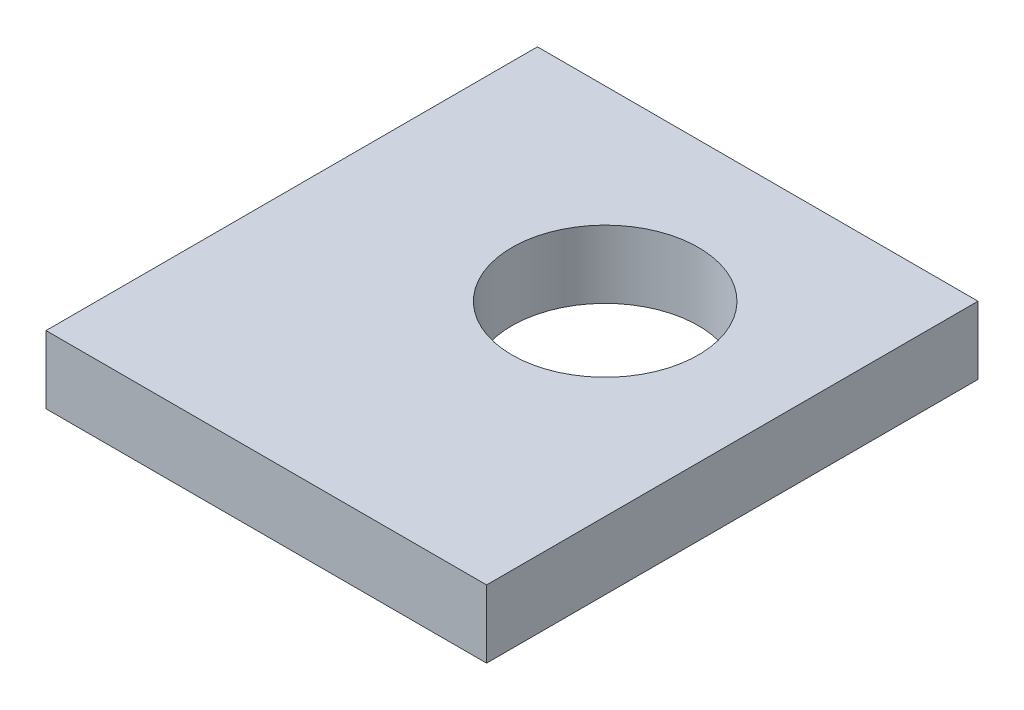
ISO-10303-21;
HEADER;
FILE_DESCRIPTION(('STEP AP214'),'2;1');
FILE_NAME('part.step','',(''),(''),'','','');
FILE_SCHEMA(('AUTOMOTIVE_DESIGN { 1 0 10303 214 1 1 1 1 }'));
ENDSEC;
DATA;
#1=APPLICATION_CONTEXT('core data for automotive mechanical design processes');
#2=APPLICATION_PROTOCOL_DEFINITION('international standard','automotive_design',2000,#1);
#3=PRODUCT_CONTEXT('',#1,'mechanical');
#4=PRODUCT('Part','Part','',(#3));
#5=PRODUCT_RELATED_PRODUCT_CATEGORY('part','',(#4));
#6=PRODUCT_DEFINITION_FORMATION('','',#4);
#7=PRODUCT_DEFINITION_CONTEXT('part definition',#1,'design');
#8=PRODUCT_DEFINITION('design','',#6,#7);
#9=PRODUCT_DEFINITION_SHAPE('','',#8);
#10=(LENGTH_UNIT() NAMED_UNIT(*) SI_UNIT(.MILLI.,.METRE.));
#11=(NAMED_UNIT(*) PLANE_ANGLE_UNIT() SI_UNIT($,.RADIAN.));
#12=(NAMED_UNIT(*) SI_UNIT($,.STERADIAN.) SOLID_ANGLE_UNIT());
#13=UNCERTAINTY_MEASURE_WITH_UNIT(LENGTH_MEASURE(1.E-05),#10,'distance_accuracy_value','');
#14=(GEOMETRIC_REPRESENTATION_CONTEXT(3) GLOBAL_UNCERTAINTY_ASSIGNED_CONTEXT((#13)) GLOBAL_UNIT_ASSIGNED_CONTEXT((#10,
#11,#12)) REPRESENTATION_CONTEXT('',''));
#15=CARTESIAN_POINT('',(0.,0.,0.));
#16=DIRECTION('',(0.,0.,1.));
#17=DIRECTION('',(1.,0.,0.));
#18=AXIS2_PLACEMENT_3D('',#15,#16,#17);
#19=CARTESIAN_POINT('',(0.,4.,0.));
#20=DIRECTION('',(0.,-1.,0.));
#21=DIRECTION('',(0.,0.,-1.));
#22=AXIS2_PLACEMENT_3D('',#19,#20,#21);
#23=PLANE('',#22);
#24=DIRECTION('',(0.,0.,1.));
#25=VECTOR('',#24,1.);
#26=CARTESIAN_POINT('',(0.,4.,0.));
#27=LINE('',#26,#25);
#28=CARTESIAN_POINT('',(0.,4.,-29.));
#29=VERTEX_POINT('',#28);
#30=CARTESIAN_POINT('',(0.,4.,0.));
#31=VERTEX_POINT('',#30);
#32=EDGE_CURVE('E86',#29,#31,#27,.T.);
#33=ORIENTED_EDGE('',*,*,#32,.T.);
#34=DIRECTION('',(1.,0.,0.));
#35=VECTOR('',#34,1.);
#36=CARTESIAN_POINT('',(0.,4.,0.));
#37=LINE('',#36,#35);
#38=CARTESIAN_POINT('',(26.,4.,0.));
#39=VERTEX_POINT('',#38);
#40=EDGE_CURVE('E81',#31,#39,#37,.T.);
#41=ORIENTED_EDGE('',*,*,#40,.T.);
#42=DIRECTION('',(0.,0.,-1.));
#43=VECTOR('',#42,1.);
#44=CARTESIAN_POINT('',(26.,4.,0.));
#45=LINE('',#44,#43);
#46=CARTESIAN_POINT('',(26.,4.,-29.));
#47=VERTEX_POINT('',#46);
#48=EDGE_CURVE('E84',#39,#47,#45,.T.);
#49=ORIENTED_EDGE('',*,*,#48,.T.);
#50=DIRECTION('',(-1.,0.,0.));
#51=VECTOR('',#50,1.);
#52=CARTESIAN_POINT('',(0.,4.,-29.));
#53=LINE('',#52,#51);
#54=EDGE_CURVE('E51',#47,#29,#53,.T.);
#55=ORIENTED_EDGE('',*,*,#54,.T.);
#56=EDGE_LOOP('',(#33,#41,#49,#55));
#57=FACE_BOUND('',#56,.T.);
#58=CARTESIAN_POINT('',(15.,4.,-18.));
#59=DIRECTION('',(0.,1.,0.));
#60=DIRECTION('',(0.,0.,1.));
#61=AXIS2_PLACEMENT_3D('',#58,#59,#60);
#62=CIRCLE('',#61,5.5);
#63=CARTESIAN_POINT('',(15.,4.,-12.5));
#64=VERTEX_POINT('',#63);
#65=EDGE_CURVE('E101',#64,#64,#62,.T.);
#66=ORIENTED_EDGE('',*,*,#65,.F.);
#67=EDGE_LOOP('',(#66));
#68=FACE_BOUND('',#67,.T.);
#69=ADVANCED_FACE('F34',(#57,#68),#23,.F.);
#70=CARTESIAN_POINT('',(0.,0.,0.));
#71=DIRECTION('',(0.,-1.,0.));
#72=DIRECTION('',(0.,0.,-1.));
#73=AXIS2_PLACEMENT_3D('',#70,#71,#72);
#74=PLANE('',#73);
#75=DIRECTION('',(0.,0.,1.));
#76=VECTOR('',#75,1.);
#77=CARTESIAN_POINT('',(0.,0.,0.));
#78=LINE('',#77,#76);
#79=CARTESIAN_POINT('',(0.,0.,-29.));
#80=VERTEX_POINT('',#79);
#81=CARTESIAN_POINT('',(0.,0.,0.));
#82=VERTEX_POINT('',#81);
#83=EDGE_CURVE('E98',#80,#82,#78,.T.);
#84=ORIENTED_EDGE('',*,*,#83,.F.);
#85=DIRECTION('',(-1.,0.,0.));
#86=VECTOR('',#85,1.);
#87=CARTESIAN_POINT('',(0.,0.,-29.));
#88=LINE('',#87,#86);
#89=CARTESIAN_POINT('',(26.,0.,-29.));
#90=VERTEX_POINT('',#89);
#91=EDGE_CURVE('E74',#90,#80,#88,.T.);
#92=ORIENTED_EDGE('',*,*,#91,.F.);
#93=DIRECTION('',(0.,0.,-1.));
#94=VECTOR('',#93,1.);
#95=CARTESIAN_POINT('',(26.,0.,0.));
#96=LINE('',#95,#94);
#97=CARTESIAN_POINT('',(26.,0.,0.));
#98=VERTEX_POINT('',#97);
#99=EDGE_CURVE('E68',#98,#90,#96,.T.);
#100=ORIENTED_EDGE('',*,*,#99,.F.);
#101=DIRECTION('',(1.,0.,0.));
#102=VECTOR('',#101,1.);
#103=CARTESIAN_POINT('',(0.,0.,0.));
#104=LINE('',#103,#102);
#105=EDGE_CURVE('E90',#82,#98,#104,.T.);
#106=ORIENTED_EDGE('',*,*,#105,.F.);
#107=EDGE_LOOP('',(#84,#92,#100,#106));
#108=FACE_BOUND('',#107,.T.);
#109=CARTESIAN_POINT('',(15.,0.,-18.));
#110=DIRECTION('',(0.,1.,0.));
#111=DIRECTION('',(0.,0.,1.));
#112=AXIS2_PLACEMENT_3D('',#109,#110,#111);
#113=CIRCLE('',#112,5.5);
#114=CARTESIAN_POINT('',(15.,0.,-12.5));
#115=VERTEX_POINT('',#114);
#116=EDGE_CURVE('E113',#115,#115,#113,.T.);
#117=ORIENTED_EDGE('',*,*,#116,.T.);
#118=EDGE_LOOP('',(#117));
#119=FACE_BOUND('',#118,.T.);
#120=ADVANCED_FACE('F109',(#108,#119),#74,.T.);
#121=CARTESIAN_POINT('',(0.,4.,0.));
#122=DIRECTION('',(1.,0.,0.));
#123=DIRECTION('',(0.,0.,-1.));
#124=AXIS2_PLACEMENT_3D('',#121,#122,#123);
#125=PLANE('',#124);
#126=ORIENTED_EDGE('',*,*,#83,.T.);
#127=DIRECTION('',(0.,-1.,0.));
#128=VECTOR('',#127,1.);
#129=CARTESIAN_POINT('',(0.,4.,0.));
#130=LINE('',#129,#128);
#131=EDGE_CURVE('E11',#31,#82,#130,.T.);
#132=ORIENTED_EDGE('',*,*,#131,.F.);
#133=ORIENTED_EDGE('',*,*,#32,.F.);
#134=DIRECTION('',(0.,-1.,0.));
#135=VECTOR('',#134,1.);
#136=CARTESIAN_POINT('',(0.,4.,-29.));
#137=LINE('',#136,#135);
#138=EDGE_CURVE('E94',#29,#80,#137,.T.);
#139=ORIENTED_EDGE('',*,*,#138,.T.);
#140=EDGE_LOOP('',(#126,#132,#133,#139));
#141=FACE_BOUND('',#140,.T.);
#142=ADVANCED_FACE('F36',(#141),#125,.F.);
#143=CARTESIAN_POINT('',(0.,4.,0.));
#144=DIRECTION('',(0.,0.,-1.));
#145=DIRECTION('',(-1.,0.,0.));
#146=AXIS2_PLACEMENT_3D('',#143,#144,#145);
#147=PLANE('',#146);
#148=ORIENTED_EDGE('',*,*,#105,.T.);
#149=DIRECTION('',(0.,-1.,0.));
#150=VECTOR('',#149,1.);
#151=CARTESIAN_POINT('',(26.,4.,0.));
#152=LINE('',#151,#150);
#153=EDGE_CURVE('E43',#39,#98,#152,.T.);
#154=ORIENTED_EDGE('',*,*,#153,.F.);
#155=ORIENTED_EDGE('',*,*,#40,.F.);
#156=ORIENTED_EDGE('',*,*,#131,.T.);
#157=EDGE_LOOP('',(#148,#154,#155,#156));
#158=FACE_BOUND('',#157,.T.);
#159=ADVANCED_FACE('F89',(#158),#147,.F.);
#160=CARTESIAN_POINT('',(26.,4.,0.));
#161=DIRECTION('',(-1.,0.,0.));
#162=DIRECTION('',(0.,0.,1.));
#163=AXIS2_PLACEMENT_3D('',#160,#161,#162);
#164=PLANE('',#163);
#165=ORIENTED_EDGE('',*,*,#99,.T.);
#166=DIRECTION('',(0.,-1.,0.));
#167=VECTOR('',#166,1.);
#168=CARTESIAN_POINT('',(26.,4.,-29.));
#169=LINE('',#168,#167);
#170=EDGE_CURVE('E91',#47,#90,#169,.T.);
#171=ORIENTED_EDGE('',*,*,#170,.F.);
#172=ORIENTED_EDGE('',*,*,#48,.F.);
#173=ORIENTED_EDGE('',*,*,#153,.T.);
#174=EDGE_LOOP('',(#165,#171,#172,#173));
#175=FACE_BOUND('',#174,.T.);
#176=ADVANCED_FACE('F92',(#175),#164,.F.);
#177=CARTESIAN_POINT('',(0.,4.,-29.));
#178=DIRECTION('',(0.,0.,1.));
#179=DIRECTION('',(1.,0.,0.));
#180=AXIS2_PLACEMENT_3D('',#177,#178,#179);
#181=PLANE('',#180);
#182=ORIENTED_EDGE('',*,*,#91,.T.);
#183=ORIENTED_EDGE('',*,*,#138,.F.);
#184=ORIENTED_EDGE('',*,*,#54,.F.);
#185=ORIENTED_EDGE('',*,*,#170,.T.);
#186=EDGE_LOOP('',(#182,#183,#184,#185));
#187=FACE_BOUND('',#186,.T.);
#188=ADVANCED_FACE('F106',(#187),#181,.F.);
#189=CARTESIAN_POINT('',(15.,4.,-18.));
#190=DIRECTION('',(0.,-1.,0.));
#191=DIRECTION('',(0.,0.,-1.));
#192=AXIS2_PLACEMENT_3D('',#189,#190,#191);
#193=CYLINDRICAL_SURFACE('',#192,5.5);
#194=ORIENTED_EDGE('',*,*,#65,.T.);
#195=EDGE_LOOP('',(#194));
#196=FACE_BOUND('',#195,.T.);
#197=ORIENTED_EDGE('',*,*,#116,.F.);
#198=EDGE_LOOP('',(#197));
#199=FACE_BOUND('',#198,.T.);
#200=ADVANCED_FACE('F119',(#196,#199),#193,.F.);
#201=CLOSED_SHELL('',(#69,#120,#142,#159,#176,#188,#200));
#202=MANIFOLD_SOLID_BREP('B2',#201);
#203=ADVANCED_BREP_SHAPE_REPRESENTATION('',(#18,#202),#14);
#204=SHAPE_DEFINITION_REPRESENTATION(#9,#203);
ENDSEC;
END-ISO-10303-21;
